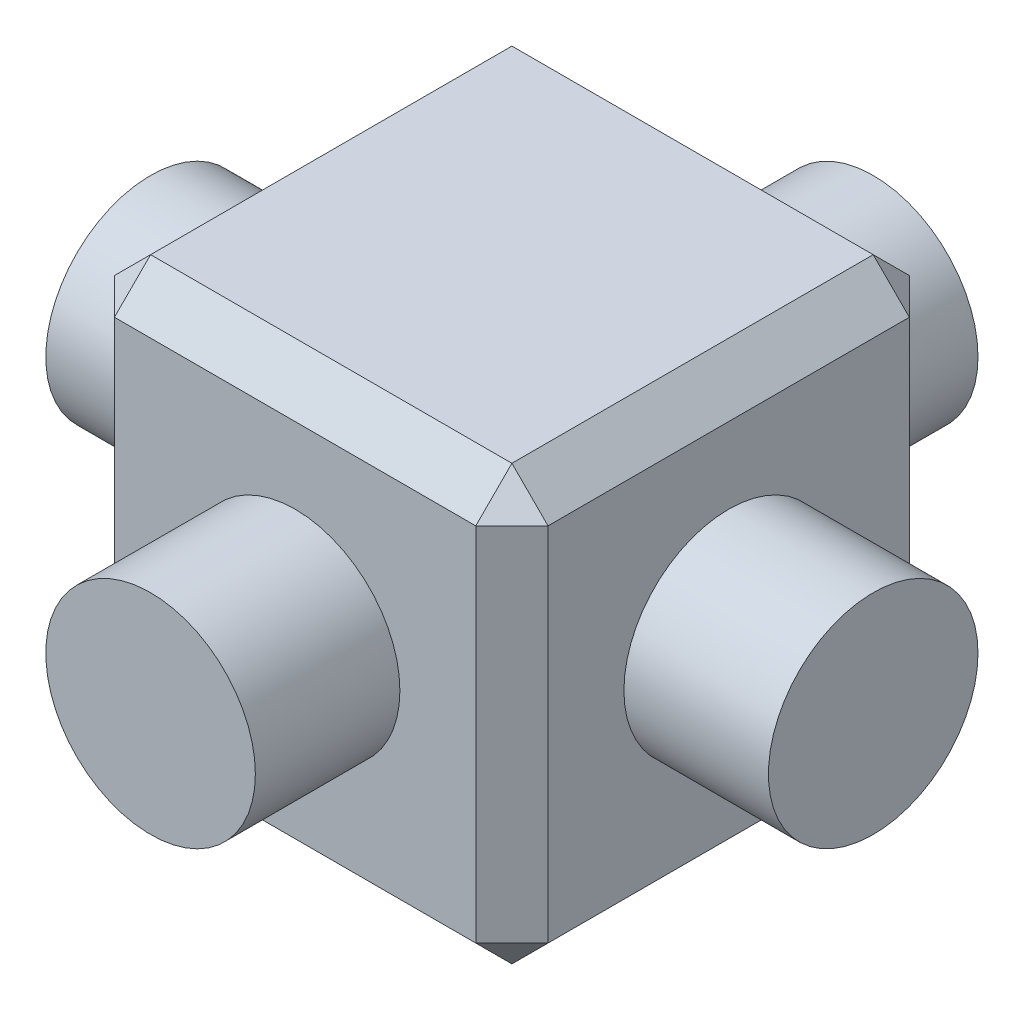
ISO-10303-21;
HEADER;
FILE_DESCRIPTION(('STEP AP214'),'2;1');
FILE_NAME('part.step','',(''),(''),'','','');
FILE_SCHEMA(('AUTOMOTIVE_DESIGN { 1 0 10303 214 1 1 1 1 }'));
ENDSEC;
DATA;
#1=APPLICATION_CONTEXT('core data for automotive mechanical design processes');
#2=APPLICATION_PROTOCOL_DEFINITION('international standard','automotive_design',2000,#1);
#3=PRODUCT_CONTEXT('',#1,'mechanical');
#4=PRODUCT('Part','Part','',(#3));
#5=PRODUCT_RELATED_PRODUCT_CATEGORY('part','',(#4));
#6=PRODUCT_DEFINITION_FORMATION('','',#4);
#7=PRODUCT_DEFINITION_CONTEXT('part definition',#1,'design');
#8=PRODUCT_DEFINITION('design','',#6,#7);
#9=PRODUCT_DEFINITION_SHAPE('','',#8);
#10=(LENGTH_UNIT() NAMED_UNIT(*) SI_UNIT(.MILLI.,.METRE.));
#11=(NAMED_UNIT(*) PLANE_ANGLE_UNIT() SI_UNIT($,.RADIAN.));
#12=(NAMED_UNIT(*) SI_UNIT($,.STERADIAN.) SOLID_ANGLE_UNIT());
#13=UNCERTAINTY_MEASURE_WITH_UNIT(LENGTH_MEASURE(1.E-05),#10,'distance_accuracy_value','');
#14=(GEOMETRIC_REPRESENTATION_CONTEXT(3) GLOBAL_UNCERTAINTY_ASSIGNED_CONTEXT((#13)) GLOBAL_UNIT_ASSIGNED_CONTEXT((#10,
#11,#12)) REPRESENTATION_CONTEXT('',''));
#15=CARTESIAN_POINT('',(0.,0.,0.));
#16=DIRECTION('',(0.,0.,1.));
#17=DIRECTION('',(1.,0.,0.));
#18=AXIS2_PLACEMENT_3D('',#15,#16,#17);
#19=CARTESIAN_POINT('',(3.,6.00000000000001,2.99999999999967));
#20=DIRECTION('',(-1.,0.,0.));
#21=DIRECTION('',(0.,0.,1.));
#22=AXIS2_PLACEMENT_3D('',#19,#20,#21);
#23=PLANE('',#22);
#24=DIRECTION('',(0.,-1.,0.));
#25=VECTOR('',#24,1.);
#26=CARTESIAN_POINT('',(3.,6.00000000000001,2.49999999999972));
#27=LINE('',#26,#25);
#28=CARTESIAN_POINT('',(3.,5.50000000000006,2.49999999999972));
#29=VERTEX_POINT('',#28);
#30=CARTESIAN_POINT('',(3.,0.500000000000056,2.49999999999995));
#31=VERTEX_POINT('',#30);
#32=EDGE_CURVE('E303',#29,#31,#27,.T.);
#33=ORIENTED_EDGE('',*,*,#32,.T.);
#34=DIRECTION('',(0.,0.,-1.));
#35=VECTOR('',#34,1.);
#36=CARTESIAN_POINT('',(3.,0.500000000000056,-3.00000000000011));
#37=LINE('',#36,#35);
#38=CARTESIAN_POINT('',(3.,0.500000000000056,-2.50000000000039));
#39=VERTEX_POINT('',#38);
#40=EDGE_CURVE('E309',#31,#39,#37,.T.);
#41=ORIENTED_EDGE('',*,*,#40,.T.);
#42=DIRECTION('',(0.,1.,0.));
#43=VECTOR('',#42,1.);
#44=CARTESIAN_POINT('',(3.,6.00000000000001,-2.50000000000017));
#45=LINE('',#44,#43);
#46=CARTESIAN_POINT('',(3.,5.50000000000006,-2.50000000000017));
#47=VERTEX_POINT('',#46);
#48=EDGE_CURVE('E306',#39,#47,#45,.T.);
#49=ORIENTED_EDGE('',*,*,#48,.T.);
#50=DIRECTION('',(0.,0.,1.));
#51=VECTOR('',#50,1.);
#52=CARTESIAN_POINT('',(3.,5.50000000000006,3.00000000000011));
#53=LINE('',#52,#51);
#54=EDGE_CURVE('E300',#47,#29,#53,.T.);
#55=ORIENTED_EDGE('',*,*,#54,.T.);
#56=EDGE_LOOP('',(#33,#41,#49,#55));
#57=FACE_BOUND('',#56,.T.);
#58=CARTESIAN_POINT('',(3.,3.,-2.22044604925031E-13));
#59=DIRECTION('',(-1.,0.,0.));
#60=DIRECTION('',(0.,0.,1.));
#61=AXIS2_PLACEMENT_3D('',#58,#59,#60);
#62=CIRCLE('',#61,1.45);
#63=CARTESIAN_POINT('',(3.,3.,1.44999999999978));
#64=VERTEX_POINT('',#63);
#65=EDGE_CURVE('E163',#64,#64,#62,.T.);
#66=ORIENTED_EDGE('',*,*,#65,.T.);
#67=EDGE_LOOP('',(#66));
#68=FACE_BOUND('',#67,.T.);
#69=ADVANCED_FACE('F47',(#57,#68),#23,.F.);
#70=CARTESIAN_POINT('',(-3.,6.00000000000001,-2.99999999999989));
#71=DIRECTION('',(0.,0.,1.));
#72=DIRECTION('',(1.,0.,0.));
#73=AXIS2_PLACEMENT_3D('',#70,#71,#72);
#74=PLANE('',#73);
#75=DIRECTION('',(0.,-1.,0.));
#76=VECTOR('',#75,1.);
#77=CARTESIAN_POINT('',(2.5,5.99999999999989,-3.00000000000011));
#78=LINE('',#77,#76);
#79=CARTESIAN_POINT('',(2.5,5.50000000000006,-3.00000000000011));
#80=VERTEX_POINT('',#79);
#81=CARTESIAN_POINT('',(2.5,0.500000000000056,-3.00000000000011));
#82=VERTEX_POINT('',#81);
#83=EDGE_CURVE('E153',#80,#82,#78,.T.);
#84=ORIENTED_EDGE('',*,*,#83,.T.);
#85=DIRECTION('',(-1.,0.,0.));
#86=VECTOR('',#85,1.);
#87=CARTESIAN_POINT('',(-3.,0.500000000000056,-3.00000000000011));
#88=LINE('',#87,#86);
#89=CARTESIAN_POINT('',(-2.50000000000001,0.500000000000056,-3.00000000000011));
#90=VERTEX_POINT('',#89);
#91=EDGE_CURVE('E148',#82,#90,#88,.T.);
#92=ORIENTED_EDGE('',*,*,#91,.T.);
#93=DIRECTION('',(0.,1.,0.));
#94=VECTOR('',#93,1.);
#95=CARTESIAN_POINT('',(-2.50000000000001,6.00000000000012,-3.00000000000011));
#96=LINE('',#95,#94);
#97=CARTESIAN_POINT('',(-2.50000000000001,5.50000000000017,-3.00000000000011));
#98=VERTEX_POINT('',#97);
#99=EDGE_CURVE('E142',#90,#98,#96,.T.);
#100=ORIENTED_EDGE('',*,*,#99,.T.);
#101=DIRECTION('',(1.,0.,0.));
#102=VECTOR('',#101,1.);
#103=CARTESIAN_POINT('',(-3.,5.50000000000006,-3.00000000000011));
#104=LINE('',#103,#102);
#105=EDGE_CURVE('E146',#98,#80,#104,.T.);
#106=ORIENTED_EDGE('',*,*,#105,.T.);
#107=EDGE_LOOP('',(#84,#92,#100,#106));
#108=FACE_BOUND('',#107,.T.);
#109=CARTESIAN_POINT('',(0.,3.,-3.00000000000011));
#110=DIRECTION('',(0.,0.,1.));
#111=DIRECTION('',(1.,0.,0.));
#112=AXIS2_PLACEMENT_3D('',#109,#110,#111);
#113=CIRCLE('',#112,1.45);
#114=CARTESIAN_POINT('',(1.45,3.,-3.00000000000011));
#115=VERTEX_POINT('',#114);
#116=EDGE_CURVE('E261',#115,#115,#113,.T.);
#117=ORIENTED_EDGE('',*,*,#116,.T.);
#118=EDGE_LOOP('',(#117));
#119=FACE_BOUND('',#118,.T.);
#120=ADVANCED_FACE('F144',(#108,#119),#74,.F.);
#121=CARTESIAN_POINT('',(-3.,6.00000000000001,2.99999999999989));
#122=DIRECTION('',(1.,0.,0.));
#123=DIRECTION('',(0.,0.,-1.));
#124=AXIS2_PLACEMENT_3D('',#121,#122,#123);
#125=PLANE('',#124);
#126=DIRECTION('',(0.,-1.,0.));
#127=VECTOR('',#126,1.);
#128=CARTESIAN_POINT('',(-3.,6.00000000000001,-2.50000000000017));
#129=LINE('',#128,#127);
#130=CARTESIAN_POINT('',(-3.,5.50000000000006,-2.50000000000017));
#131=VERTEX_POINT('',#130);
#132=CARTESIAN_POINT('',(-3.,0.499999999999945,-2.50000000000017));
#133=VERTEX_POINT('',#132);
#134=EDGE_CURVE('E175',#131,#133,#129,.T.);
#135=ORIENTED_EDGE('',*,*,#134,.T.);
#136=DIRECTION('',(0.,0.,1.));
#137=VECTOR('',#136,1.);
#138=CARTESIAN_POINT('',(-3.,0.500000000000056,3.00000000000011));
#139=LINE('',#138,#137);
#140=CARTESIAN_POINT('',(-3.,0.500000000000056,2.49999999999972));
#141=VERTEX_POINT('',#140);
#142=EDGE_CURVE('E334',#133,#141,#139,.T.);
#143=ORIENTED_EDGE('',*,*,#142,.T.);
#144=DIRECTION('',(0.,1.,0.));
#145=VECTOR('',#144,1.);
#146=CARTESIAN_POINT('',(-3.,6.00000000000001,2.49999999999995));
#147=LINE('',#146,#145);
#148=CARTESIAN_POINT('',(-3.,5.50000000000006,2.49999999999995));
#149=VERTEX_POINT('',#148);
#150=EDGE_CURVE('E329',#141,#149,#147,.T.);
#151=ORIENTED_EDGE('',*,*,#150,.T.);
#152=DIRECTION('',(0.,0.,-1.));
#153=VECTOR('',#152,1.);
#154=CARTESIAN_POINT('',(-3.,5.50000000000006,2.99999999999967));
#155=LINE('',#154,#153);
#156=EDGE_CURVE('E326',#149,#131,#155,.T.);
#157=ORIENTED_EDGE('',*,*,#156,.T.);
#158=EDGE_LOOP('',(#135,#143,#151,#157));
#159=FACE_BOUND('',#158,.T.);
#160=CARTESIAN_POINT('',(-3.,3.,-2.22044604925031E-13));
#161=DIRECTION('',(1.,0.,0.));
#162=DIRECTION('',(0.,0.,-1.));
#163=AXIS2_PLACEMENT_3D('',#160,#161,#162);
#164=CIRCLE('',#163,1.45);
#165=CARTESIAN_POINT('',(-3.,3.,-1.45000000000022));
#166=VERTEX_POINT('',#165);
#167=EDGE_CURVE('E273',#166,#166,#164,.T.);
#168=ORIENTED_EDGE('',*,*,#167,.T.);
#169=EDGE_LOOP('',(#168));
#170=FACE_BOUND('',#169,.T.);
#171=ADVANCED_FACE('F392',(#159,#170),#125,.F.);
#172=CARTESIAN_POINT('',(-3.,6.00000000000001,2.99999999999989));
#173=DIRECTION('',(0.,0.,-1.));
#174=DIRECTION('',(-1.,0.,0.));
#175=AXIS2_PLACEMENT_3D('',#172,#173,#174);
#176=PLANE('',#175);
#177=DIRECTION('',(0.,-1.,0.));
#178=VECTOR('',#177,1.);
#179=CARTESIAN_POINT('',(-2.50000000000001,6.00000000000012,2.99999999999967));
#180=LINE('',#179,#178);
#181=CARTESIAN_POINT('',(-2.5,5.50000000000006,2.99999999999989));
#182=VERTEX_POINT('',#181);
#183=CARTESIAN_POINT('',(-2.50000000000001,0.500000000000056,3.00000000000011));
#184=VERTEX_POINT('',#183);
#185=EDGE_CURVE('E316',#182,#184,#180,.T.);
#186=ORIENTED_EDGE('',*,*,#185,.T.);
#187=DIRECTION('',(1.,0.,0.));
#188=VECTOR('',#187,1.);
#189=CARTESIAN_POINT('',(3.,0.500000000000056,2.99999999999989));
#190=LINE('',#189,#188);
#191=CARTESIAN_POINT('',(2.5,0.499999999999945,2.99999999999989));
#192=VERTEX_POINT('',#191);
#193=EDGE_CURVE('E322',#184,#192,#190,.T.);
#194=ORIENTED_EDGE('',*,*,#193,.T.);
#195=DIRECTION('',(0.,1.,0.));
#196=VECTOR('',#195,1.);
#197=CARTESIAN_POINT('',(2.5,6.00000000000001,2.99999999999967));
#198=LINE('',#197,#196);
#199=CARTESIAN_POINT('',(2.5,5.50000000000006,2.99999999999967));
#200=VERTEX_POINT('',#199);
#201=EDGE_CURVE('E319',#192,#200,#198,.T.);
#202=ORIENTED_EDGE('',*,*,#201,.T.);
#203=DIRECTION('',(-1.,0.,0.));
#204=VECTOR('',#203,1.);
#205=CARTESIAN_POINT('',(-3.,5.50000000000006,2.99999999999967));
#206=LINE('',#205,#204);
#207=EDGE_CURVE('E313',#200,#182,#206,.T.);
#208=ORIENTED_EDGE('',*,*,#207,.T.);
#209=EDGE_LOOP('',(#186,#194,#202,#208));
#210=FACE_BOUND('',#209,.T.);
#211=CARTESIAN_POINT('',(0.,3.,3.00000000000011));
#212=DIRECTION('',(0.,0.,-1.));
#213=DIRECTION('',(-1.,0.,0.));
#214=AXIS2_PLACEMENT_3D('',#211,#212,#213);
#215=CIRCLE('',#214,1.45);
#216=CARTESIAN_POINT('',(-1.45,3.,3.00000000000011));
#217=VERTEX_POINT('',#216);
#218=EDGE_CURVE('E258',#217,#217,#215,.T.);
#219=ORIENTED_EDGE('',*,*,#218,.T.);
#220=EDGE_LOOP('',(#219));
#221=FACE_BOUND('',#220,.T.);
#222=ADVANCED_FACE('F735',(#210,#221),#176,.F.);
#223=CARTESIAN_POINT('',(0.,6.00000000000001,-2.22044604925031E-13));
#224=DIRECTION('',(0.,-1.,0.));
#225=DIRECTION('',(0.,0.,-1.));
#226=AXIS2_PLACEMENT_3D('',#223,#224,#225);
#227=PLANE('',#226);
#228=DIRECTION('',(1.,0.,0.));
#229=VECTOR('',#228,1.);
#230=CARTESIAN_POINT('',(0.,5.99999999999989,2.49999999999972));
#231=LINE('',#230,#229);
#232=CARTESIAN_POINT('',(-2.50000000000001,6.00000000000012,2.49999999999995));
#233=VERTEX_POINT('',#232);
#234=CARTESIAN_POINT('',(2.5,6.00000000000001,2.49999999999995));
#235=VERTEX_POINT('',#234);
#236=EDGE_CURVE('E73',#233,#235,#231,.T.);
#237=ORIENTED_EDGE('',*,*,#236,.T.);
#238=DIRECTION('',(0.,0.,-1.));
#239=VECTOR('',#238,1.);
#240=CARTESIAN_POINT('',(2.5,6.00000000000001,0.));
#241=LINE('',#240,#239);
#242=CARTESIAN_POINT('',(2.5,6.00000000000001,-2.50000000000017));
#243=VERTEX_POINT('',#242);
#244=EDGE_CURVE('E11',#235,#243,#241,.T.);
#245=ORIENTED_EDGE('',*,*,#244,.T.);
#246=DIRECTION('',(-1.,0.,0.));
#247=VECTOR('',#246,1.);
#248=CARTESIAN_POINT('',(0.,5.99999999999989,-2.50000000000017));
#249=LINE('',#248,#247);
#250=CARTESIAN_POINT('',(-2.50000000000001,6.00000000000012,-2.50000000000017));
#251=VERTEX_POINT('',#250);
#252=EDGE_CURVE('E58',#243,#251,#249,.T.);
#253=ORIENTED_EDGE('',*,*,#252,.T.);
#254=DIRECTION('',(0.,0.,1.));
#255=VECTOR('',#254,1.);
#256=CARTESIAN_POINT('',(-2.50000000000001,6.00000000000012,-2.22044604925031E-13));
#257=LINE('',#256,#255);
#258=EDGE_CURVE('E338',#251,#233,#257,.T.);
#259=ORIENTED_EDGE('',*,*,#258,.T.);
#260=EDGE_LOOP('',(#237,#245,#253,#259));
#261=FACE_BOUND('',#260,.T.);
#262=ADVANCED_FACE('F399',(#261),#227,.F.);
#263=CARTESIAN_POINT('',(0.,0.,0.));
#264=DIRECTION('',(0.,-1.,0.));
#265=DIRECTION('',(0.,0.,-1.));
#266=AXIS2_PLACEMENT_3D('',#263,#264,#265);
#267=PLANE('',#266);
#268=DIRECTION('',(0.,0.,-1.));
#269=VECTOR('',#268,1.);
#270=CARTESIAN_POINT('',(-2.5,0.,-3.00000000000011));
#271=LINE('',#270,#269);
#272=CARTESIAN_POINT('',(-2.50000000000001,0.,2.50000000000017));
#273=VERTEX_POINT('',#272);
#274=CARTESIAN_POINT('',(-2.50000000000001,0.,-2.49999999999995));
#275=VERTEX_POINT('',#274);
#276=EDGE_CURVE('E287',#273,#275,#271,.T.);
#277=ORIENTED_EDGE('',*,*,#276,.T.);
#278=DIRECTION('',(1.,0.,0.));
#279=VECTOR('',#278,1.);
#280=CARTESIAN_POINT('',(3.,0.,-2.50000000000017));
#281=LINE('',#280,#279);
#282=CARTESIAN_POINT('',(2.5,1.11022302462516E-13,-2.50000000000017));
#283=VERTEX_POINT('',#282);
#284=EDGE_CURVE('E296',#275,#283,#281,.T.);
#285=ORIENTED_EDGE('',*,*,#284,.T.);
#286=DIRECTION('',(0.,0.,1.));
#287=VECTOR('',#286,1.);
#288=CARTESIAN_POINT('',(2.5,1.11022302462516E-13,2.99999999999989));
#289=LINE('',#288,#287);
#290=CARTESIAN_POINT('',(2.5,1.11022302462516E-13,2.49999999999972));
#291=VERTEX_POINT('',#290);
#292=EDGE_CURVE('E293',#283,#291,#289,.T.);
#293=ORIENTED_EDGE('',*,*,#292,.T.);
#294=DIRECTION('',(-1.,0.,0.));
#295=VECTOR('',#294,1.);
#296=CARTESIAN_POINT('',(-3.,0.,2.49999999999972));
#297=LINE('',#296,#295);
#298=EDGE_CURVE('E290',#291,#273,#297,.T.);
#299=ORIENTED_EDGE('',*,*,#298,.T.);
#300=EDGE_LOOP('',(#277,#285,#293,#299));
#301=FACE_BOUND('',#300,.T.);
#302=ADVANCED_FACE('F379',(#301),#267,.T.);
#303=CARTESIAN_POINT('',(-5.,3.00000000000011,-2.22044604925031E-13));
#304=DIRECTION('',(1.,0.,0.));
#305=DIRECTION('',(0.,0.,-1.));
#306=AXIS2_PLACEMENT_3D('',#303,#304,#305);
#307=PLANE('',#306);
#308=CARTESIAN_POINT('',(-5.,3.00000000000011,-2.22044604925031E-13));
#309=DIRECTION('',(1.,0.,0.));
#310=DIRECTION('',(0.,0.,-1.));
#311=AXIS2_PLACEMENT_3D('',#308,#309,#310);
#312=CIRCLE('',#311,1.45);
#313=CARTESIAN_POINT('',(-5.,3.00000000000011,-1.45000000000022));
#314=VERTEX_POINT('',#313);
#315=EDGE_CURVE('E269',#314,#314,#312,.T.);
#316=ORIENTED_EDGE('',*,*,#315,.F.);
#317=EDGE_LOOP('',(#316));
#318=FACE_BOUND('',#317,.T.);
#319=ADVANCED_FACE('F712',(#318),#307,.F.);
#320=CARTESIAN_POINT('',(-5.,3.00000000000011,-2.22044604925031E-13));
#321=DIRECTION('',(1.,0.,0.));
#322=DIRECTION('',(0.,0.,-1.));
#323=AXIS2_PLACEMENT_3D('',#320,#321,#322);
#324=CYLINDRICAL_SURFACE('',#323,1.45);
#325=ORIENTED_EDGE('',*,*,#315,.T.);
#326=EDGE_LOOP('',(#325));
#327=FACE_BOUND('',#326,.T.);
#328=ORIENTED_EDGE('',*,*,#167,.F.);
#329=EDGE_LOOP('',(#328));
#330=FACE_BOUND('',#329,.T.);
#331=ADVANCED_FACE('F703',(#327,#330),#324,.T.);
#332=CARTESIAN_POINT('',(5.,3.,-2.22044604925031E-13));
#333=DIRECTION('',(1.,0.,0.));
#334=DIRECTION('',(0.,0.,-1.));
#335=AXIS2_PLACEMENT_3D('',#332,#333,#334);
#336=CIRCLE('',#335,1.45);
#337=CARTESIAN_POINT('',(5.,3.,-1.45000000000022));
#338=VERTEX_POINT('',#337);
#339=EDGE_CURVE('E265',#338,#338,#336,.T.);
#340=ORIENTED_EDGE('',*,*,#339,.F.);
#341=EDGE_LOOP('',(#340));
#342=FACE_BOUND('',#341,.T.);
#343=ORIENTED_EDGE('',*,*,#65,.F.);
#344=EDGE_LOOP('',(#343));
#345=FACE_BOUND('',#344,.T.);
#346=ADVANCED_FACE('F694',(#342,#345),#324,.T.);
#347=CARTESIAN_POINT('',(5.,3.,-2.22044604925031E-13));
#348=DIRECTION('',(1.,0.,0.));
#349=DIRECTION('',(0.,0.,-1.));
#350=AXIS2_PLACEMENT_3D('',#347,#348,#349);
#351=PLANE('',#350);
#352=ORIENTED_EDGE('',*,*,#339,.T.);
#353=EDGE_LOOP('',(#352));
#354=FACE_BOUND('',#353,.T.);
#355=ADVANCED_FACE('F686',(#354),#351,.T.);
#356=CARTESIAN_POINT('',(0.,3.,4.99999999999989));
#357=DIRECTION('',(0.,0.,1.));
#358=DIRECTION('',(1.,0.,0.));
#359=AXIS2_PLACEMENT_3D('',#356,#357,#358);
#360=PLANE('',#359);
#361=CARTESIAN_POINT('',(0.,3.,4.99999999999989));
#362=DIRECTION('',(0.,0.,1.));
#363=DIRECTION('',(1.,0.,0.));
#364=AXIS2_PLACEMENT_3D('',#361,#362,#363);
#365=CIRCLE('',#364,1.45);
#366=CARTESIAN_POINT('',(1.45,3.,4.99999999999989));
#367=VERTEX_POINT('',#366);
#368=EDGE_CURVE('E242',#367,#367,#365,.T.);
#369=ORIENTED_EDGE('',*,*,#368,.T.);
#370=EDGE_LOOP('',(#369));
#371=FACE_BOUND('',#370,.T.);
#372=ADVANCED_FACE('F678',(#371),#360,.T.);
#373=CARTESIAN_POINT('',(0.,3.,-5.00000000000034));
#374=DIRECTION('',(0.,0.,1.));
#375=DIRECTION('',(1.,0.,0.));
#376=AXIS2_PLACEMENT_3D('',#373,#374,#375);
#377=CYLINDRICAL_SURFACE('',#376,1.45);
#378=ORIENTED_EDGE('',*,*,#368,.F.);
#379=EDGE_LOOP('',(#378));
#380=FACE_BOUND('',#379,.T.);
#381=ORIENTED_EDGE('',*,*,#218,.F.);
#382=EDGE_LOOP('',(#381));
#383=FACE_BOUND('',#382,.T.);
#384=ADVANCED_FACE('F669',(#380,#383),#377,.T.);
#385=CARTESIAN_POINT('',(0.,3.,-5.00000000000034));
#386=DIRECTION('',(0.,0.,1.));
#387=DIRECTION('',(1.,0.,0.));
#388=AXIS2_PLACEMENT_3D('',#385,#386,#387);
#389=CIRCLE('',#388,1.45);
#390=CARTESIAN_POINT('',(1.45,3.,-5.00000000000034));
#391=VERTEX_POINT('',#390);
#392=EDGE_CURVE('E250',#391,#391,#389,.T.);
#393=ORIENTED_EDGE('',*,*,#392,.T.);
#394=EDGE_LOOP('',(#393));
#395=FACE_BOUND('',#394,.T.);
#396=ORIENTED_EDGE('',*,*,#116,.F.);
#397=EDGE_LOOP('',(#396));
#398=FACE_BOUND('',#397,.T.);
#399=ADVANCED_FACE('F660',(#395,#398),#377,.T.);
#400=CARTESIAN_POINT('',(0.,3.,-5.00000000000034));
#401=DIRECTION('',(0.,0.,1.));
#402=DIRECTION('',(1.,0.,0.));
#403=AXIS2_PLACEMENT_3D('',#400,#401,#402);
#404=PLANE('',#403);
#405=ORIENTED_EDGE('',*,*,#392,.F.);
#406=EDGE_LOOP('',(#405));
#407=FACE_BOUND('',#406,.T.);
#408=ADVANCED_FACE('F653',(#407),#404,.F.);
#409=CARTESIAN_POINT('',(0.,5.99999999999989,2.49999999999972));
#410=DIRECTION('',(0.,-0.707106781186545,-0.70710678118655));
#411=DIRECTION('',(1.,0.,0.));
#412=AXIS2_PLACEMENT_3D('',#409,#410,#411);
#413=PLANE('',#412);
#414=DIRECTION('',(0.,0.70710678118655,-0.707106781186545));
#415=VECTOR('',#414,1.);
#416=CARTESIAN_POINT('',(2.5,5.50000000000006,2.99999999999967));
#417=LINE('',#416,#415);
#418=EDGE_CURVE('E52',#235,#200,#417,.F.);
#419=ORIENTED_EDGE('',*,*,#418,.F.);
#420=ORIENTED_EDGE('',*,*,#236,.F.);
#421=DIRECTION('',(0.,-0.70710678118655,0.707106781186545));
#422=VECTOR('',#421,1.);
#423=CARTESIAN_POINT('',(-2.5,5.74999999999992,2.74999999999959));
#424=LINE('',#423,#422);
#425=EDGE_CURVE('E231',#182,#233,#424,.F.);
#426=ORIENTED_EDGE('',*,*,#425,.F.);
#427=ORIENTED_EDGE('',*,*,#207,.F.);
#428=EDGE_LOOP('',(#419,#420,#426,#427));
#429=FACE_BOUND('',#428,.T.);
#430=ADVANCED_FACE('F50',(#429),#413,.F.);
#431=CARTESIAN_POINT('',(2.5,5.50000000000006,2.99999999999967));
#432=DIRECTION('',(0.577350269189626,0.577350269189622,0.57735026918963));
#433=DIRECTION('',(0.70710678118655,0.,-0.707106781186545));
#434=AXIS2_PLACEMENT_3D('',#431,#432,#433);
#435=PLANE('',#434);
#436=DIRECTION('',(0.707106781186545,-0.70710678118655,0.));
#437=VECTOR('',#436,1.);
#438=CARTESIAN_POINT('',(2.75,5.75000000000014,2.49999999999995));
#439=LINE('',#438,#437);
#440=EDGE_CURVE('E224',#235,#29,#439,.T.);
#441=ORIENTED_EDGE('',*,*,#440,.F.);
#442=ORIENTED_EDGE('',*,*,#418,.T.);
#443=DIRECTION('',(-0.70710678118655,0.,0.707106781186545));
#444=VECTOR('',#443,1.);
#445=CARTESIAN_POINT('',(2.5,5.50000000000006,2.99999999999967));
#446=LINE('',#445,#444);
#447=EDGE_CURVE('E228',#29,#200,#446,.T.);
#448=ORIENTED_EDGE('',*,*,#447,.F.);
#449=EDGE_LOOP('',(#441,#442,#448));
#450=FACE_BOUND('',#449,.T.);
#451=ADVANCED_FACE('F403',(#450),#435,.T.);
#452=CARTESIAN_POINT('',(-3.,5.50000000000006,2.49999999999995));
#453=DIRECTION('',(-0.57735026918963,0.577350269189622,0.577350269189626));
#454=DIRECTION('',(0.707106781186545,0.,0.70710678118655));
#455=AXIS2_PLACEMENT_3D('',#452,#453,#454);
#456=PLANE('',#455);
#457=DIRECTION('',(-0.707106781186545,0.,-0.70710678118655));
#458=VECTOR('',#457,1.);
#459=CARTESIAN_POINT('',(-3.,5.50000000000006,2.49999999999995));
#460=LINE('',#459,#458);
#461=EDGE_CURVE('E216',#182,#149,#460,.T.);
#462=ORIENTED_EDGE('',*,*,#461,.F.);
#463=ORIENTED_EDGE('',*,*,#425,.T.);
#464=DIRECTION('',(0.707106781186545,0.70710678118655,0.));
#465=VECTOR('',#464,1.);
#466=CARTESIAN_POINT('',(-3.,5.50000000000006,2.49999999999995));
#467=LINE('',#466,#465);
#468=EDGE_CURVE('E220',#149,#233,#467,.T.);
#469=ORIENTED_EDGE('',*,*,#468,.F.);
#470=EDGE_LOOP('',(#462,#463,#469));
#471=FACE_BOUND('',#470,.T.);
#472=ADVANCED_FACE('F431',(#471),#456,.T.);
#473=CARTESIAN_POINT('',(3.,6.00000000000001,2.49999999999972));
#474=DIRECTION('',(-0.707106781186545,0.,-0.70710678118655));
#475=DIRECTION('',(0.,-1.,0.));
#476=AXIS2_PLACEMENT_3D('',#473,#474,#475);
#477=PLANE('',#476);
#478=ORIENTED_EDGE('',*,*,#447,.T.);
#479=ORIENTED_EDGE('',*,*,#201,.F.);
#480=DIRECTION('',(0.70710678118655,0.,-0.707106781186545));
#481=VECTOR('',#480,1.);
#482=CARTESIAN_POINT('',(2.75,0.499999999999945,2.74999999999981));
#483=LINE('',#482,#481);
#484=EDGE_CURVE('E209',#31,#192,#483,.F.);
#485=ORIENTED_EDGE('',*,*,#484,.F.);
#486=ORIENTED_EDGE('',*,*,#32,.F.);
#487=EDGE_LOOP('',(#478,#479,#485,#486));
#488=FACE_BOUND('',#487,.T.);
#489=ADVANCED_FACE('F417',(#488),#477,.F.);
#490=CARTESIAN_POINT('',(2.5,6.00000000000001,0.));
#491=DIRECTION('',(-0.70710678118655,-0.707106781186545,0.));
#492=DIRECTION('',(0.,0.,-1.));
#493=AXIS2_PLACEMENT_3D('',#490,#491,#492);
#494=PLANE('',#493);
#495=ORIENTED_EDGE('',*,*,#440,.T.);
#496=ORIENTED_EDGE('',*,*,#54,.F.);
#497=DIRECTION('',(-0.707106781186545,0.70710678118655,0.));
#498=VECTOR('',#497,1.);
#499=CARTESIAN_POINT('',(3.,5.50000000000006,-2.50000000000017));
#500=LINE('',#499,#498);
#501=EDGE_CURVE('E206',#243,#47,#500,.F.);
#502=ORIENTED_EDGE('',*,*,#501,.F.);
#503=ORIENTED_EDGE('',*,*,#244,.F.);
#504=EDGE_LOOP('',(#495,#496,#502,#503));
#505=FACE_BOUND('',#504,.T.);
#506=ADVANCED_FACE('F407',(#505),#494,.F.);
#507=CARTESIAN_POINT('',(0.,5.99999999999989,-2.50000000000017));
#508=DIRECTION('',(0.,-0.707106781186545,0.70710678118655));
#509=DIRECTION('',(-1.,0.,0.));
#510=AXIS2_PLACEMENT_3D('',#507,#508,#509);
#511=PLANE('',#510);
#512=DIRECTION('',(0.,0.70710678118655,0.707106781186545));
#513=VECTOR('',#512,1.);
#514=CARTESIAN_POINT('',(-2.50000000000001,5.50000000000017,-3.00000000000011));
#515=LINE('',#514,#513);
#516=EDGE_CURVE('E160',#251,#98,#515,.F.);
#517=ORIENTED_EDGE('',*,*,#516,.F.);
#518=ORIENTED_EDGE('',*,*,#252,.F.);
#519=DIRECTION('',(0.,-0.70710678118655,-0.707106781186545));
#520=VECTOR('',#519,1.);
#521=CARTESIAN_POINT('',(2.5,5.75000000000003,-2.75000000000003));
#522=LINE('',#521,#520);
#523=EDGE_CURVE('E66',#80,#243,#522,.F.);
#524=ORIENTED_EDGE('',*,*,#523,.F.);
#525=ORIENTED_EDGE('',*,*,#105,.F.);
#526=EDGE_LOOP('',(#517,#518,#524,#525));
#527=FACE_BOUND('',#526,.T.);
#528=ADVANCED_FACE('F158',(#527),#511,.F.);
#529=CARTESIAN_POINT('',(-2.50000000000001,6.00000000000012,-2.22044604925031E-13));
#530=DIRECTION('',(0.70710678118655,-0.707106781186545,0.));
#531=DIRECTION('',(0.,0.,1.));
#532=AXIS2_PLACEMENT_3D('',#529,#530,#531);
#533=PLANE('',#532);
#534=ORIENTED_EDGE('',*,*,#468,.T.);
#535=ORIENTED_EDGE('',*,*,#258,.F.);
#536=DIRECTION('',(-0.707106781186545,-0.70710678118655,0.));
#537=VECTOR('',#536,1.);
#538=CARTESIAN_POINT('',(-2.75000000000001,5.75000000000003,-2.49999999999995));
#539=LINE('',#538,#537);
#540=EDGE_CURVE('E171',#131,#251,#539,.F.);
#541=ORIENTED_EDGE('',*,*,#540,.F.);
#542=ORIENTED_EDGE('',*,*,#156,.F.);
#543=EDGE_LOOP('',(#534,#535,#541,#542));
#544=FACE_BOUND('',#543,.T.);
#545=ADVANCED_FACE('F398',(#544),#533,.F.);
#546=CARTESIAN_POINT('',(-2.50000000000001,6.00000000000012,2.99999999999967));
#547=DIRECTION('',(0.70710678118655,0.,-0.707106781186545));
#548=DIRECTION('',(0.,-1.,0.));
#549=AXIS2_PLACEMENT_3D('',#546,#547,#548);
#550=PLANE('',#549);
#551=ORIENTED_EDGE('',*,*,#461,.T.);
#552=ORIENTED_EDGE('',*,*,#150,.F.);
#553=DIRECTION('',(0.707106781186545,0.,0.70710678118655));
#554=VECTOR('',#553,1.);
#555=CARTESIAN_POINT('',(-2.75,0.500000000000056,2.75000000000003));
#556=LINE('',#555,#554);
#557=EDGE_CURVE('E198',#184,#141,#556,.F.);
#558=ORIENTED_EDGE('',*,*,#557,.F.);
#559=ORIENTED_EDGE('',*,*,#185,.F.);
#560=EDGE_LOOP('',(#551,#552,#558,#559));
#561=FACE_BOUND('',#560,.T.);
#562=ADVANCED_FACE('F430',(#561),#550,.F.);
#563=CARTESIAN_POINT('',(-3.,0.500000000000056,3.00000000000011));
#564=DIRECTION('',(0.,-0.70710678118655,0.707106781186545));
#565=DIRECTION('',(-1.,0.,0.));
#566=AXIS2_PLACEMENT_3D('',#563,#564,#565);
#567=PLANE('',#566);
#568=DIRECTION('',(0.,-0.707106781186545,-0.70710678118655));
#569=VECTOR('',#568,1.);
#570=CARTESIAN_POINT('',(2.5,1.11022302462516E-13,2.49999999999972));
#571=LINE('',#570,#569);
#572=EDGE_CURVE('E212',#192,#291,#571,.T.);
#573=ORIENTED_EDGE('',*,*,#572,.F.);
#574=ORIENTED_EDGE('',*,*,#193,.F.);
#575=DIRECTION('',(0.,0.707106781186545,0.70710678118655));
#576=VECTOR('',#575,1.);
#577=CARTESIAN_POINT('',(-2.50000000000001,0.,2.50000000000017));
#578=LINE('',#577,#576);
#579=EDGE_CURVE('E194',#273,#184,#578,.T.);
#580=ORIENTED_EDGE('',*,*,#579,.F.);
#581=ORIENTED_EDGE('',*,*,#298,.F.);
#582=EDGE_LOOP('',(#573,#574,#580,#581));
#583=FACE_BOUND('',#582,.T.);
#584=ADVANCED_FACE('F423',(#583),#567,.T.);
#585=CARTESIAN_POINT('',(2.5,1.11022302462516E-13,2.49999999999972));
#586=DIRECTION('',(0.577350269189622,-0.57735026918963,0.577350269189626));
#587=DIRECTION('',(0.,-0.707106781186545,-0.70710678118655));
#588=AXIS2_PLACEMENT_3D('',#585,#586,#587);
#589=PLANE('',#588);
#590=ORIENTED_EDGE('',*,*,#484,.T.);
#591=ORIENTED_EDGE('',*,*,#572,.T.);
#592=DIRECTION('',(0.70710678118655,0.707106781186545,0.));
#593=VECTOR('',#592,1.);
#594=CARTESIAN_POINT('',(2.5,1.11022302462516E-13,2.49999999999972));
#595=LINE('',#594,#593);
#596=EDGE_CURVE('E185',#31,#291,#595,.F.);
#597=ORIENTED_EDGE('',*,*,#596,.F.);
#598=EDGE_LOOP('',(#590,#591,#597));
#599=FACE_BOUND('',#598,.T.);
#600=ADVANCED_FACE('F420',(#599),#589,.T.);
#601=CARTESIAN_POINT('',(3.,5.50000000000006,-2.50000000000017));
#602=DIRECTION('',(0.57735026918963,0.577350269189622,-0.577350269189626));
#603=DIRECTION('',(-0.707106781186545,0.,-0.70710678118655));
#604=AXIS2_PLACEMENT_3D('',#601,#602,#603);
#605=PLANE('',#604);
#606=ORIENTED_EDGE('',*,*,#523,.T.);
#607=ORIENTED_EDGE('',*,*,#501,.T.);
#608=DIRECTION('',(0.707106781186545,0.,0.70710678118655));
#609=VECTOR('',#608,1.);
#610=CARTESIAN_POINT('',(3.,5.50000000000006,-2.50000000000017));
#611=LINE('',#610,#609);
#612=EDGE_CURVE('E177',#80,#47,#611,.T.);
#613=ORIENTED_EDGE('',*,*,#612,.F.);
#614=EDGE_LOOP('',(#606,#607,#613));
#615=FACE_BOUND('',#614,.T.);
#616=ADVANCED_FACE('F408',(#615),#605,.T.);
#617=CARTESIAN_POINT('',(-2.50000000000001,5.50000000000017,-3.00000000000011));
#618=DIRECTION('',(-0.57735026918963,0.577350269189622,-0.577350269189626));
#619=DIRECTION('',(-0.707106781186545,0.,0.70710678118655));
#620=AXIS2_PLACEMENT_3D('',#617,#618,#619);
#621=PLANE('',#620);
#622=ORIENTED_EDGE('',*,*,#540,.T.);
#623=ORIENTED_EDGE('',*,*,#516,.T.);
#624=DIRECTION('',(0.707106781186545,0.,-0.70710678118655));
#625=VECTOR('',#624,1.);
#626=CARTESIAN_POINT('',(-2.50000000000001,5.50000000000017,-3.00000000000011));
#627=LINE('',#626,#625);
#628=EDGE_CURVE('E168',#131,#98,#627,.T.);
#629=ORIENTED_EDGE('',*,*,#628,.F.);
#630=EDGE_LOOP('',(#622,#623,#629));
#631=FACE_BOUND('',#630,.T.);
#632=ADVANCED_FACE('F167',(#631),#621,.T.);
#633=CARTESIAN_POINT('',(-2.50000000000001,0.,2.50000000000017));
#634=DIRECTION('',(-0.57735026918963,-0.577350269189626,0.577350269189622));
#635=DIRECTION('',(0.707106781186545,-0.70710678118655,0.));
#636=AXIS2_PLACEMENT_3D('',#633,#634,#635);
#637=PLANE('',#636);
#638=ORIENTED_EDGE('',*,*,#579,.T.);
#639=ORIENTED_EDGE('',*,*,#557,.T.);
#640=DIRECTION('',(0.707106781186545,-0.70710678118655,0.));
#641=VECTOR('',#640,1.);
#642=CARTESIAN_POINT('',(-2.50000000000001,0.,2.50000000000017));
#643=LINE('',#642,#641);
#644=EDGE_CURVE('E178',#273,#141,#643,.F.);
#645=ORIENTED_EDGE('',*,*,#644,.F.);
#646=EDGE_LOOP('',(#638,#639,#645));
#647=FACE_BOUND('',#646,.T.);
#648=ADVANCED_FACE('F427',(#647),#637,.T.);
#649=CARTESIAN_POINT('',(3.,0.500000000000056,2.99999999999989));
#650=DIRECTION('',(0.707106781186545,-0.70710678118655,0.));
#651=DIRECTION('',(0.,0.,1.));
#652=AXIS2_PLACEMENT_3D('',#649,#650,#651);
#653=PLANE('',#652);
#654=ORIENTED_EDGE('',*,*,#596,.T.);
#655=ORIENTED_EDGE('',*,*,#292,.F.);
#656=DIRECTION('',(-0.70710678118655,-0.707106781186545,0.));
#657=VECTOR('',#656,1.);
#658=CARTESIAN_POINT('',(2.5,1.11022302462516E-13,-2.50000000000017));
#659=LINE('',#658,#657);
#660=EDGE_CURVE('E187',#39,#283,#659,.T.);
#661=ORIENTED_EDGE('',*,*,#660,.F.);
#662=ORIENTED_EDGE('',*,*,#40,.F.);
#663=EDGE_LOOP('',(#654,#655,#661,#662));
#664=FACE_BOUND('',#663,.T.);
#665=ADVANCED_FACE('F374',(#664),#653,.T.);
#666=CARTESIAN_POINT('',(2.5,5.99999999999989,-3.00000000000011));
#667=DIRECTION('',(-0.70710678118655,0.,0.707106781186545));
#668=DIRECTION('',(0.,-1.,0.));
#669=AXIS2_PLACEMENT_3D('',#666,#667,#668);
#670=PLANE('',#669);
#671=ORIENTED_EDGE('',*,*,#612,.T.);
#672=ORIENTED_EDGE('',*,*,#48,.F.);
#673=DIRECTION('',(-0.707106781186545,0.,-0.70710678118655));
#674=VECTOR('',#673,1.);
#675=CARTESIAN_POINT('',(2.75,0.500000000000056,-2.75000000000003));
#676=LINE('',#675,#674);
#677=EDGE_CURVE('E359',#82,#39,#676,.F.);
#678=ORIENTED_EDGE('',*,*,#677,.F.);
#679=ORIENTED_EDGE('',*,*,#83,.F.);
#680=EDGE_LOOP('',(#671,#672,#678,#679));
#681=FACE_BOUND('',#680,.T.);
#682=ADVANCED_FACE('F411',(#681),#670,.F.);
#683=CARTESIAN_POINT('',(-3.,6.00000000000001,-2.50000000000017));
#684=DIRECTION('',(0.70710678118655,0.,0.707106781186545));
#685=DIRECTION('',(0.,-1.,0.));
#686=AXIS2_PLACEMENT_3D('',#683,#684,#685);
#687=PLANE('',#686);
#688=ORIENTED_EDGE('',*,*,#628,.T.);
#689=ORIENTED_EDGE('',*,*,#99,.F.);
#690=DIRECTION('',(-0.707106781186545,0.,0.70710678118655));
#691=VECTOR('',#690,1.);
#692=CARTESIAN_POINT('',(-2.50000000000001,0.500000000000056,-3.00000000000011));
#693=LINE('',#692,#691);
#694=EDGE_CURVE('E355',#133,#90,#693,.F.);
#695=ORIENTED_EDGE('',*,*,#694,.F.);
#696=ORIENTED_EDGE('',*,*,#134,.F.);
#697=EDGE_LOOP('',(#688,#689,#695,#696));
#698=FACE_BOUND('',#697,.T.);
#699=ADVANCED_FACE('F174',(#698),#687,.F.);
#700=CARTESIAN_POINT('',(-3.,0.500000000000056,3.00000000000011));
#701=DIRECTION('',(-0.70710678118655,-0.707106781186545,0.));
#702=DIRECTION('',(0.,0.,-1.));
#703=AXIS2_PLACEMENT_3D('',#700,#701,#702);
#704=PLANE('',#703);
#705=ORIENTED_EDGE('',*,*,#644,.T.);
#706=ORIENTED_EDGE('',*,*,#142,.F.);
#707=DIRECTION('',(-0.707106781186545,0.70710678118655,0.));
#708=VECTOR('',#707,1.);
#709=CARTESIAN_POINT('',(-2.75,0.250000000000083,-2.50000000000017));
#710=LINE('',#709,#708);
#711=EDGE_CURVE('E351',#275,#133,#710,.T.);
#712=ORIENTED_EDGE('',*,*,#711,.F.);
#713=ORIENTED_EDGE('',*,*,#276,.F.);
#714=EDGE_LOOP('',(#705,#706,#712,#713));
#715=FACE_BOUND('',#714,.T.);
#716=ADVANCED_FACE('F389',(#715),#704,.T.);
#717=CARTESIAN_POINT('',(2.5,1.11022302462516E-13,-2.50000000000017));
#718=DIRECTION('',(0.577350269189626,-0.57735026918963,-0.577350269189622));
#719=DIRECTION('',(0.70710678118655,0.707106781186545,0.));
#720=AXIS2_PLACEMENT_3D('',#717,#718,#719);
#721=PLANE('',#720);
#722=ORIENTED_EDGE('',*,*,#677,.T.);
#723=ORIENTED_EDGE('',*,*,#660,.T.);
#724=DIRECTION('',(0.,0.707106781186545,-0.70710678118655));
#725=VECTOR('',#724,1.);
#726=CARTESIAN_POINT('',(2.5,1.11022302462516E-13,-2.50000000000017));
#727=LINE('',#726,#725);
#728=EDGE_CURVE('E348',#82,#283,#727,.F.);
#729=ORIENTED_EDGE('',*,*,#728,.F.);
#730=EDGE_LOOP('',(#722,#723,#729));
#731=FACE_BOUND('',#730,.T.);
#732=ADVANCED_FACE('F369',(#731),#721,.T.);
#733=CARTESIAN_POINT('',(-2.50000000000001,0.500000000000056,-3.00000000000011));
#734=DIRECTION('',(-0.57735026918963,-0.577350269189626,-0.577350269189622));
#735=DIRECTION('',(0.707106781186545,-0.70710678118655,0.));
#736=AXIS2_PLACEMENT_3D('',#733,#734,#735);
#737=PLANE('',#736);
#738=ORIENTED_EDGE('',*,*,#711,.T.);
#739=ORIENTED_EDGE('',*,*,#694,.T.);
#740=DIRECTION('',(0.,-0.707106781186545,0.70710678118655));
#741=VECTOR('',#740,1.);
#742=CARTESIAN_POINT('',(-2.50000000000001,0.500000000000056,-3.00000000000011));
#743=LINE('',#742,#741);
#744=EDGE_CURVE('E345',#275,#90,#743,.F.);
#745=ORIENTED_EDGE('',*,*,#744,.F.);
#746=EDGE_LOOP('',(#738,#739,#745));
#747=FACE_BOUND('',#746,.T.);
#748=ADVANCED_FACE('F386',(#747),#737,.T.);
#749=CARTESIAN_POINT('',(-3.,0.500000000000056,-3.00000000000011));
#750=DIRECTION('',(0.,-0.70710678118655,-0.707106781186545));
#751=DIRECTION('',(1.,0.,0.));
#752=AXIS2_PLACEMENT_3D('',#749,#750,#751);
#753=PLANE('',#752);
#754=ORIENTED_EDGE('',*,*,#728,.T.);
#755=ORIENTED_EDGE('',*,*,#284,.F.);
#756=ORIENTED_EDGE('',*,*,#744,.T.);
#757=ORIENTED_EDGE('',*,*,#91,.F.);
#758=EDGE_LOOP('',(#754,#755,#756,#757));
#759=FACE_BOUND('',#758,.T.);
#760=ADVANCED_FACE('F384',(#759),#753,.T.);
#761=CLOSED_SHELL('',(#69,#120,#171,#222,#262,#302,#319,#331,#346,#355,#372,#384,#399,#408,#430,
#451,#472,#489,#506,#528,#545,#562,#584,#600,#616,#632,#648,#665,#682,#699,#716,#732,#748,#760));
#762=MANIFOLD_SOLID_BREP('B2',#761);
#763=ADVANCED_BREP_SHAPE_REPRESENTATION('',(#18,#762),#14);
#764=SHAPE_DEFINITION_REPRESENTATION(#9,#763);
ENDSEC;
END-ISO-10303-21;
